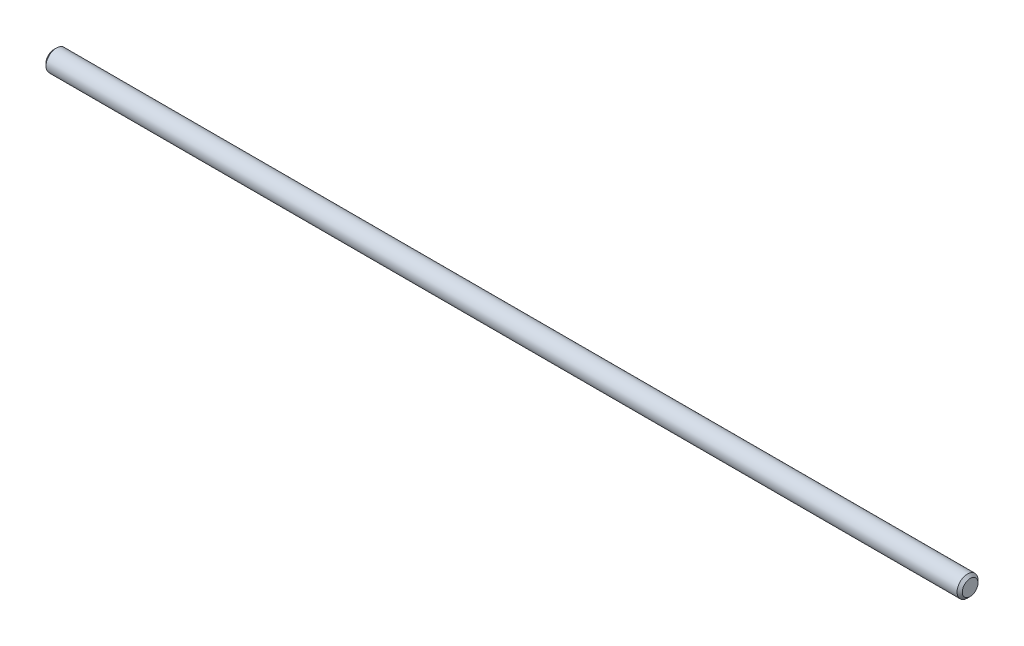
ISO-10303-21;
HEADER;
FILE_DESCRIPTION(('STEP AP214'),'2;1');
FILE_NAME('part.step','',(''),(''),'','','');
FILE_SCHEMA(('AUTOMOTIVE_DESIGN { 1 0 10303 214 1 1 1 1 }'));
ENDSEC;
DATA;
#1=APPLICATION_CONTEXT('core data for automotive mechanical design processes');
#2=APPLICATION_PROTOCOL_DEFINITION('international standard','automotive_design',2000,#1);
#3=PRODUCT_CONTEXT('',#1,'mechanical');
#4=PRODUCT('Part','Part','',(#3));
#5=PRODUCT_RELATED_PRODUCT_CATEGORY('part','',(#4));
#6=PRODUCT_DEFINITION_FORMATION('','',#4);
#7=PRODUCT_DEFINITION_CONTEXT('part definition',#1,'design');
#8=PRODUCT_DEFINITION('design','',#6,#7);
#9=PRODUCT_DEFINITION_SHAPE('','',#8);
#10=(LENGTH_UNIT() NAMED_UNIT(*) SI_UNIT(.MILLI.,.METRE.));
#11=(NAMED_UNIT(*) PLANE_ANGLE_UNIT() SI_UNIT($,.RADIAN.));
#12=(NAMED_UNIT(*) SI_UNIT($,.STERADIAN.) SOLID_ANGLE_UNIT());
#13=UNCERTAINTY_MEASURE_WITH_UNIT(LENGTH_MEASURE(1.E-05),#10,'distance_accuracy_value','');
#14=(GEOMETRIC_REPRESENTATION_CONTEXT(3) GLOBAL_UNCERTAINTY_ASSIGNED_CONTEXT((#13)) GLOBAL_UNIT_ASSIGNED_CONTEXT((#10,
#11,#12)) REPRESENTATION_CONTEXT('',''));
#15=CARTESIAN_POINT('',(0.,0.,0.));
#16=DIRECTION('',(0.,0.,1.));
#17=DIRECTION('',(1.,0.,0.));
#18=AXIS2_PLACEMENT_3D('',#15,#16,#17);
#19=CARTESIAN_POINT('',(-175.,0.,0.));
#20=DIRECTION('',(1.,0.,0.));
#21=DIRECTION('',(0.,0.,-1.));
#22=AXIS2_PLACEMENT_3D('',#19,#20,#21);
#23=CYLINDRICAL_SURFACE('',#22,4.);
#24=CARTESIAN_POINT('',(-174.,0.,0.));
#25=DIRECTION('',(1.,0.,0.));
#26=DIRECTION('',(0.,0.,-1.));
#27=AXIS2_PLACEMENT_3D('',#24,#25,#26);
#28=CIRCLE('',#27,4.);
#29=CARTESIAN_POINT('',(-174.,0.,-4.));
#30=VERTEX_POINT('',#29);
#31=EDGE_CURVE('E41',#30,#30,#28,.T.);
#32=ORIENTED_EDGE('',*,*,#31,.T.);
#33=EDGE_LOOP('',(#32));
#34=FACE_BOUND('',#33,.T.);
#35=CARTESIAN_POINT('',(174.,0.,0.));
#36=DIRECTION('',(1.,0.,0.));
#37=DIRECTION('',(0.,0.,-1.));
#38=AXIS2_PLACEMENT_3D('',#35,#36,#37);
#39=CIRCLE('',#38,4.);
#40=CARTESIAN_POINT('',(174.,0.,-4.));
#41=VERTEX_POINT('',#40);
#42=EDGE_CURVE('E45',#41,#41,#39,.F.);
#43=ORIENTED_EDGE('',*,*,#42,.T.);
#44=EDGE_LOOP('',(#43));
#45=FACE_BOUND('',#44,.T.);
#46=ADVANCED_FACE('F30',(#34,#45),#23,.T.);
#47=CARTESIAN_POINT('',(-175.,0.,0.));
#48=DIRECTION('',(1.,0.,0.));
#49=DIRECTION('',(0.,0.,-1.));
#50=AXIS2_PLACEMENT_3D('',#47,#48,#49);
#51=PLANE('',#50);
#52=CARTESIAN_POINT('',(-175.,0.,0.));
#53=DIRECTION('',(1.,0.,0.));
#54=DIRECTION('',(0.,0.,-1.));
#55=AXIS2_PLACEMENT_3D('',#52,#53,#54);
#56=CIRCLE('',#55,3.);
#57=CARTESIAN_POINT('',(-175.,0.,-3.));
#58=VERTEX_POINT('',#57);
#59=EDGE_CURVE('E37',#58,#58,#56,.F.);
#60=ORIENTED_EDGE('',*,*,#59,.T.);
#61=EDGE_LOOP('',(#60));
#62=FACE_BOUND('',#61,.T.);
#63=ADVANCED_FACE('F61',(#62),#51,.F.);
#64=CARTESIAN_POINT('',(175.,0.,0.));
#65=DIRECTION('',(1.,0.,0.));
#66=DIRECTION('',(0.,0.,-1.));
#67=AXIS2_PLACEMENT_3D('',#64,#65,#66);
#68=PLANE('',#67);
#69=CARTESIAN_POINT('',(175.,0.,0.));
#70=DIRECTION('',(1.,0.,0.));
#71=DIRECTION('',(0.,0.,-1.));
#72=AXIS2_PLACEMENT_3D('',#69,#70,#71);
#73=CIRCLE('',#72,3.00000000000003);
#74=CARTESIAN_POINT('',(175.,0.,-3.00000000000003));
#75=VERTEX_POINT('',#74);
#76=EDGE_CURVE('E10',#75,#75,#73,.T.);
#77=ORIENTED_EDGE('',*,*,#76,.T.);
#78=EDGE_LOOP('',(#77));
#79=FACE_BOUND('',#78,.T.);
#80=ADVANCED_FACE('F58',(#79),#68,.T.);
#81=CARTESIAN_POINT('',(-174.,0.,0.));
#82=DIRECTION('',(1.,0.,0.));
#83=DIRECTION('',(0.,0.,-1.));
#84=AXIS2_PLACEMENT_3D('',#81,#82,#83);
#85=CONICAL_SURFACE('',#84,4.,0.785398163397433);
#86=ORIENTED_EDGE('',*,*,#59,.F.);
#87=EDGE_LOOP('',(#86));
#88=FACE_BOUND('',#87,.T.);
#89=ORIENTED_EDGE('',*,*,#31,.F.);
#90=EDGE_LOOP('',(#89));
#91=FACE_BOUND('',#90,.T.);
#92=ADVANCED_FACE('F54',(#88,#91),#85,.T.);
#93=CARTESIAN_POINT('',(175.,0.,0.));
#94=DIRECTION('',(-1.,0.,0.));
#95=DIRECTION('',(0.,0.,1.));
#96=AXIS2_PLACEMENT_3D('',#93,#94,#95);
#97=CONICAL_SURFACE('',#96,3.00000000000003,0.785398163397461);
#98=ORIENTED_EDGE('',*,*,#42,.F.);
#99=EDGE_LOOP('',(#98));
#100=FACE_BOUND('',#99,.T.);
#101=ORIENTED_EDGE('',*,*,#76,.F.);
#102=EDGE_LOOP('',(#101));
#103=FACE_BOUND('',#102,.T.);
#104=ADVANCED_FACE('F32',(#100,#103),#97,.T.);
#105=CLOSED_SHELL('',(#46,#63,#80,#92,#104));
#106=MANIFOLD_SOLID_BREP('B2',#105);
#107=ADVANCED_BREP_SHAPE_REPRESENTATION('',(#18,#106),#14);
#108=SHAPE_DEFINITION_REPRESENTATION(#9,#107);
ENDSEC;
END-ISO-10303-21;
